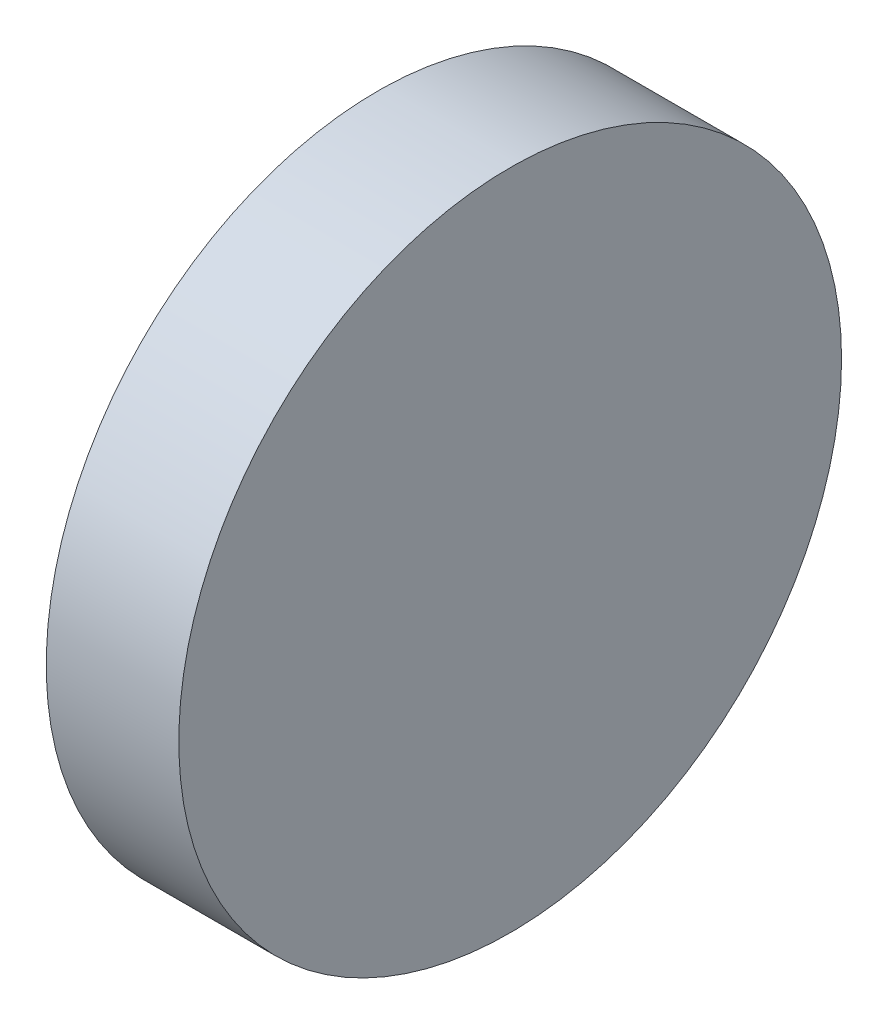
ISO-10303-21;
HEADER;
FILE_DESCRIPTION(('STEP AP214'),'2;1');
FILE_NAME('part.step','',(''),(''),'','','');
FILE_SCHEMA(('AUTOMOTIVE_DESIGN { 1 0 10303 214 1 1 1 1 }'));
ENDSEC;
DATA;
#1=APPLICATION_CONTEXT('core data for automotive mechanical design processes');
#2=APPLICATION_PROTOCOL_DEFINITION('international standard','automotive_design',2000,#1);
#3=PRODUCT_CONTEXT('',#1,'mechanical');
#4=PRODUCT('Part','Part','',(#3));
#5=PRODUCT_RELATED_PRODUCT_CATEGORY('part','',(#4));
#6=PRODUCT_DEFINITION_FORMATION('','',#4);
#7=PRODUCT_DEFINITION_CONTEXT('part definition',#1,'design');
#8=PRODUCT_DEFINITION('design','',#6,#7);
#9=PRODUCT_DEFINITION_SHAPE('','',#8);
#10=(LENGTH_UNIT() NAMED_UNIT(*) SI_UNIT(.MILLI.,.METRE.));
#11=(NAMED_UNIT(*) PLANE_ANGLE_UNIT() SI_UNIT($,.RADIAN.));
#12=(NAMED_UNIT(*) SI_UNIT($,.STERADIAN.) SOLID_ANGLE_UNIT());
#13=UNCERTAINTY_MEASURE_WITH_UNIT(LENGTH_MEASURE(1.E-05),#10,'distance_accuracy_value','');
#14=(GEOMETRIC_REPRESENTATION_CONTEXT(3) GLOBAL_UNCERTAINTY_ASSIGNED_CONTEXT((#13)) GLOBAL_UNIT_ASSIGNED_CONTEXT((#10,
#11,#12)) REPRESENTATION_CONTEXT('',''));
#15=CARTESIAN_POINT('',(0.,0.,0.));
#16=DIRECTION('',(0.,0.,1.));
#17=DIRECTION('',(1.,0.,0.));
#18=AXIS2_PLACEMENT_3D('',#15,#16,#17);
#19=CARTESIAN_POINT('',(12.7,0.,0.));
#20=DIRECTION('',(-1.,0.,0.));
#21=DIRECTION('',(0.,0.,1.));
#22=AXIS2_PLACEMENT_3D('',#19,#20,#21);
#23=CYLINDRICAL_SURFACE('',#22,31.75);
#24=CARTESIAN_POINT('',(12.7,0.,0.));
#25=DIRECTION('',(1.,0.,0.));
#26=DIRECTION('',(0.,0.,-1.));
#27=AXIS2_PLACEMENT_3D('',#24,#25,#26);
#28=CIRCLE('',#27,31.75);
#29=CARTESIAN_POINT('',(12.7,0.,-31.75));
#30=VERTEX_POINT('',#29);
#31=EDGE_CURVE('E10',#30,#30,#28,.T.);
#32=ORIENTED_EDGE('',*,*,#31,.F.);
#33=EDGE_LOOP('',(#32));
#34=FACE_BOUND('',#33,.T.);
#35=CARTESIAN_POINT('',(0.,0.,0.));
#36=DIRECTION('',(1.,0.,0.));
#37=DIRECTION('',(0.,0.,-1.));
#38=AXIS2_PLACEMENT_3D('',#35,#36,#37);
#39=CIRCLE('',#38,31.75);
#40=CARTESIAN_POINT('',(0.,0.,-31.75));
#41=VERTEX_POINT('',#40);
#42=EDGE_CURVE('E34',#41,#41,#39,.T.);
#43=ORIENTED_EDGE('',*,*,#42,.T.);
#44=EDGE_LOOP('',(#43));
#45=FACE_BOUND('',#44,.T.);
#46=ADVANCED_FACE('F31',(#34,#45),#23,.T.);
#47=CARTESIAN_POINT('',(12.7,0.,0.));
#48=DIRECTION('',(1.,0.,0.));
#49=DIRECTION('',(0.,0.,-1.));
#50=AXIS2_PLACEMENT_3D('',#47,#48,#49);
#51=PLANE('',#50);
#52=ORIENTED_EDGE('',*,*,#31,.T.);
#53=EDGE_LOOP('',(#52));
#54=FACE_BOUND('',#53,.T.);
#55=ADVANCED_FACE('F46',(#54),#51,.T.);
#56=CARTESIAN_POINT('',(0.,0.,0.));
#57=DIRECTION('',(1.,0.,0.));
#58=DIRECTION('',(0.,0.,-1.));
#59=AXIS2_PLACEMENT_3D('',#56,#57,#58);
#60=PLANE('',#59);
#61=ORIENTED_EDGE('',*,*,#42,.F.);
#62=EDGE_LOOP('',(#61));
#63=FACE_BOUND('',#62,.T.);
#64=ADVANCED_FACE('F44',(#63),#60,.F.);
#65=CLOSED_SHELL('',(#46,#55,#64));
#66=MANIFOLD_SOLID_BREP('B2',#65);
#67=ADVANCED_BREP_SHAPE_REPRESENTATION('',(#18,#66),#14);
#68=SHAPE_DEFINITION_REPRESENTATION(#9,#67);
ENDSEC;
END-ISO-10303-21;
